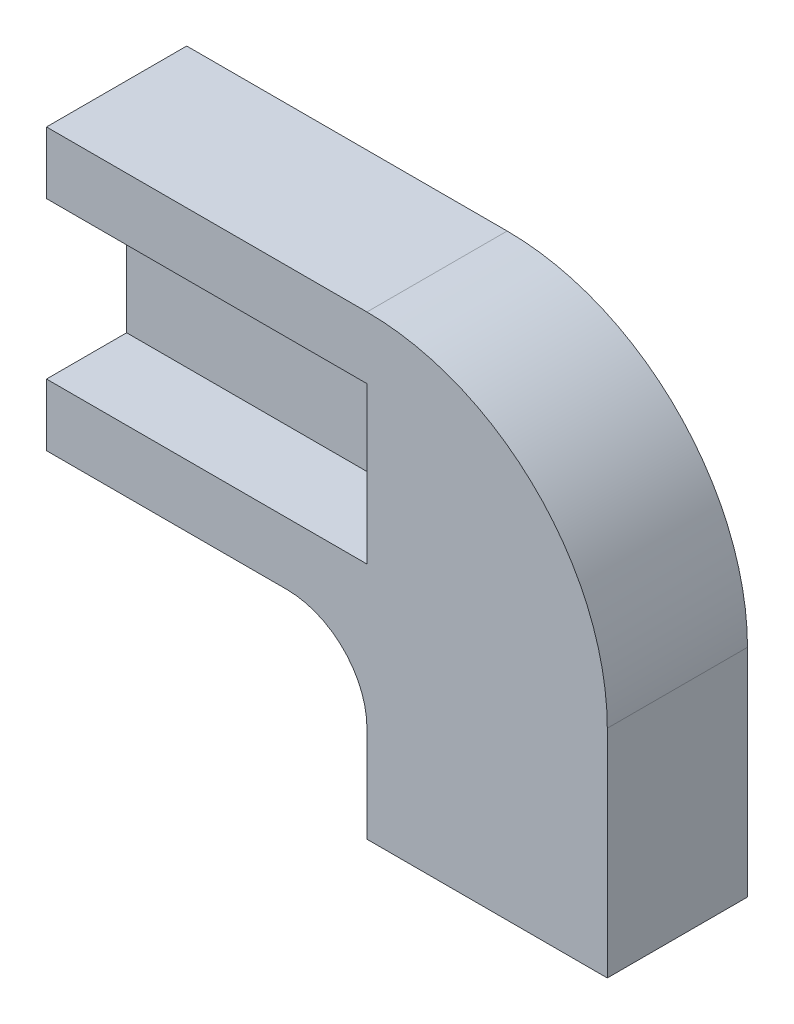
ISO-10303-21;
HEADER;
FILE_DESCRIPTION(('STEP AP214'),'2;1');
FILE_NAME('part.step','',(''),(''),'','','');
FILE_SCHEMA(('AUTOMOTIVE_DESIGN { 1 0 10303 214 1 1 1 1 }'));
ENDSEC;
DATA;
#1=APPLICATION_CONTEXT('core data for automotive mechanical design processes');
#2=APPLICATION_PROTOCOL_DEFINITION('international standard','automotive_design',2000,#1);
#3=PRODUCT_CONTEXT('',#1,'mechanical');
#4=PRODUCT('Part','Part','',(#3));
#5=PRODUCT_RELATED_PRODUCT_CATEGORY('part','',(#4));
#6=PRODUCT_DEFINITION_FORMATION('','',#4);
#7=PRODUCT_DEFINITION_CONTEXT('part definition',#1,'design');
#8=PRODUCT_DEFINITION('design','',#6,#7);
#9=PRODUCT_DEFINITION_SHAPE('','',#8);
#10=(LENGTH_UNIT() NAMED_UNIT(*) SI_UNIT(.MILLI.,.METRE.));
#11=(NAMED_UNIT(*) PLANE_ANGLE_UNIT() SI_UNIT($,.RADIAN.));
#12=(NAMED_UNIT(*) SI_UNIT($,.STERADIAN.) SOLID_ANGLE_UNIT());
#13=UNCERTAINTY_MEASURE_WITH_UNIT(LENGTH_MEASURE(1.E-05),#10,'distance_accuracy_value','');
#14=(GEOMETRIC_REPRESENTATION_CONTEXT(3) GLOBAL_UNCERTAINTY_ASSIGNED_CONTEXT((#13)) GLOBAL_UNIT_ASSIGNED_CONTEXT((#10,
#11,#12)) REPRESENTATION_CONTEXT('',''));
#15=CARTESIAN_POINT('',(0.,0.,0.));
#16=DIRECTION('',(0.,0.,1.));
#17=DIRECTION('',(1.,0.,0.));
#18=AXIS2_PLACEMENT_3D('',#15,#16,#17);
#19=CARTESIAN_POINT('',(0.,-8.89,4.445));
#20=DIRECTION('',(1.,0.,0.));
#21=DIRECTION('',(0.,0.,-1.));
#22=AXIS2_PLACEMENT_3D('',#19,#20,#21);
#23=PLANE('',#22);
#24=DIRECTION('',(0.,-1.,0.));
#25=VECTOR('',#24,1.);
#26=CARTESIAN_POINT('',(0.,-1.9685,1.905));
#27=LINE('',#26,#25);
#28=CARTESIAN_POINT('',(0.,-1.9685,1.905));
#29=VERTEX_POINT('',#28);
#30=CARTESIAN_POINT('',(0.,-6.9215,1.905));
#31=VERTEX_POINT('',#30);
#32=EDGE_CURVE('E132',#29,#31,#27,.T.);
#33=ORIENTED_EDGE('',*,*,#32,.F.);
#34=DIRECTION('',(0.,0.,1.));
#35=VECTOR('',#34,1.);
#36=CARTESIAN_POINT('',(0.,-1.9685,1.905));
#37=LINE('',#36,#35);
#38=CARTESIAN_POINT('',(0.,-1.9685,4.445));
#39=VERTEX_POINT('',#38);
#40=EDGE_CURVE('E171',#29,#39,#37,.T.);
#41=ORIENTED_EDGE('',*,*,#40,.T.);
#42=DIRECTION('',(0.,-1.,0.));
#43=VECTOR('',#42,1.);
#44=CARTESIAN_POINT('',(0.,-8.89,4.445));
#45=LINE('',#44,#43);
#46=CARTESIAN_POINT('',(0.,0.,4.445));
#47=VERTEX_POINT('',#46);
#48=EDGE_CURVE('E152',#47,#39,#45,.T.);
#49=ORIENTED_EDGE('',*,*,#48,.F.);
#50=DIRECTION('',(0.,0.,-1.));
#51=VECTOR('',#50,1.);
#52=CARTESIAN_POINT('',(0.,0.,4.445));
#53=LINE('',#52,#51);
#54=CARTESIAN_POINT('',(0.,0.,0.));
#55=VERTEX_POINT('',#54);
#56=EDGE_CURVE('E166',#47,#55,#53,.T.);
#57=ORIENTED_EDGE('',*,*,#56,.T.);
#58=DIRECTION('',(0.,-1.,0.));
#59=VECTOR('',#58,1.);
#60=CARTESIAN_POINT('',(0.,-8.89,0.));
#61=LINE('',#60,#59);
#62=CARTESIAN_POINT('',(0.,-8.89,0.));
#63=VERTEX_POINT('',#62);
#64=EDGE_CURVE('E167',#55,#63,#61,.T.);
#65=ORIENTED_EDGE('',*,*,#64,.T.);
#66=DIRECTION('',(0.,0.,-1.));
#67=VECTOR('',#66,1.);
#68=CARTESIAN_POINT('',(0.,-8.89,4.445));
#69=LINE('',#68,#67);
#70=CARTESIAN_POINT('',(0.,-8.89,4.445));
#71=VERTEX_POINT('',#70);
#72=EDGE_CURVE('E190',#71,#63,#69,.T.);
#73=ORIENTED_EDGE('',*,*,#72,.F.);
#74=CARTESIAN_POINT('',(0.,-6.9215,4.445));
#75=VERTEX_POINT('',#74);
#76=EDGE_CURVE('E145',#75,#71,#45,.T.);
#77=ORIENTED_EDGE('',*,*,#76,.F.);
#78=DIRECTION('',(0.,0.,1.));
#79=VECTOR('',#78,1.);
#80=CARTESIAN_POINT('',(0.,-6.9215,1.905));
#81=LINE('',#80,#79);
#82=EDGE_CURVE('E125',#31,#75,#81,.T.);
#83=ORIENTED_EDGE('',*,*,#82,.F.);
#84=EDGE_LOOP('',(#33,#41,#49,#57,#65,#73,#77,#83));
#85=FACE_BOUND('',#84,.T.);
#86=ADVANCED_FACE('F32',(#85),#23,.F.);
#87=CARTESIAN_POINT('',(10.16,-8.89,4.445));
#88=DIRECTION('',(0.,1.,0.));
#89=DIRECTION('',(-1.,0.,0.));
#90=AXIS2_PLACEMENT_3D('',#87,#88,#89);
#91=PLANE('',#90);
#92=DIRECTION('',(1.,0.,0.));
#93=VECTOR('',#92,1.);
#94=CARTESIAN_POINT('',(10.16,-8.89,0.));
#95=LINE('',#94,#93);
#96=CARTESIAN_POINT('',(7.62,-8.89,0.));
#97=VERTEX_POINT('',#96);
#98=EDGE_CURVE('E170',#63,#97,#95,.T.);
#99=ORIENTED_EDGE('',*,*,#98,.T.);
#100=DIRECTION('',(0.,0.,-1.));
#101=VECTOR('',#100,1.);
#102=CARTESIAN_POINT('',(7.62,-8.89,4.445));
#103=LINE('',#102,#101);
#104=CARTESIAN_POINT('',(7.62,-8.89,4.445));
#105=VERTEX_POINT('',#104);
#106=EDGE_CURVE('E196',#97,#105,#103,.F.);
#107=ORIENTED_EDGE('',*,*,#106,.T.);
#108=DIRECTION('',(1.,0.,0.));
#109=VECTOR('',#108,1.);
#110=CARTESIAN_POINT('',(10.16,-8.89,4.445));
#111=LINE('',#110,#109);
#112=EDGE_CURVE('E155',#71,#105,#111,.T.);
#113=ORIENTED_EDGE('',*,*,#112,.F.);
#114=ORIENTED_EDGE('',*,*,#72,.T.);
#115=EDGE_LOOP('',(#99,#107,#113,#114));
#116=FACE_BOUND('',#115,.T.);
#117=ADVANCED_FACE('F226',(#116),#91,.F.);
#118=CARTESIAN_POINT('',(10.16,-14.478,4.445));
#119=DIRECTION('',(1.,0.,0.));
#120=DIRECTION('',(0.,0.,-1.));
#121=AXIS2_PLACEMENT_3D('',#118,#119,#120);
#122=PLANE('',#121);
#123=DIRECTION('',(0.,-1.,0.));
#124=VECTOR('',#123,1.);
#125=CARTESIAN_POINT('',(10.16,-14.478,4.445));
#126=LINE('',#125,#124);
#127=CARTESIAN_POINT('',(10.16,-11.43,4.445));
#128=VERTEX_POINT('',#127);
#129=CARTESIAN_POINT('',(10.16,-14.478,4.445));
#130=VERTEX_POINT('',#129);
#131=EDGE_CURVE('E158',#128,#130,#126,.T.);
#132=ORIENTED_EDGE('',*,*,#131,.F.);
#133=DIRECTION('',(0.,0.,-1.));
#134=VECTOR('',#133,1.);
#135=CARTESIAN_POINT('',(10.16,-11.43,0.));
#136=LINE('',#135,#134);
#137=CARTESIAN_POINT('',(10.16,-11.43,0.));
#138=VERTEX_POINT('',#137);
#139=EDGE_CURVE('E193',#128,#138,#136,.T.);
#140=ORIENTED_EDGE('',*,*,#139,.T.);
#141=DIRECTION('',(0.,-1.,0.));
#142=VECTOR('',#141,1.);
#143=CARTESIAN_POINT('',(10.16,-14.478,0.));
#144=LINE('',#143,#142);
#145=CARTESIAN_POINT('',(10.16,-14.478,0.));
#146=VERTEX_POINT('',#145);
#147=EDGE_CURVE('E174',#138,#146,#144,.T.);
#148=ORIENTED_EDGE('',*,*,#147,.T.);
#149=DIRECTION('',(0.,0.,-1.));
#150=VECTOR('',#149,1.);
#151=CARTESIAN_POINT('',(10.16,-14.478,4.445));
#152=LINE('',#151,#150);
#153=EDGE_CURVE('E187',#130,#146,#152,.T.);
#154=ORIENTED_EDGE('',*,*,#153,.F.);
#155=EDGE_LOOP('',(#132,#140,#148,#154));
#156=FACE_BOUND('',#155,.T.);
#157=ADVANCED_FACE('F231',(#156),#122,.F.);
#158=CARTESIAN_POINT('',(17.78,-14.478,4.445));
#159=DIRECTION('',(0.,1.,0.));
#160=DIRECTION('',(-1.,0.,0.));
#161=AXIS2_PLACEMENT_3D('',#158,#159,#160);
#162=PLANE('',#161);
#163=DIRECTION('',(1.,0.,0.));
#164=VECTOR('',#163,1.);
#165=CARTESIAN_POINT('',(17.78,-14.478,0.));
#166=LINE('',#165,#164);
#167=CARTESIAN_POINT('',(17.78,-14.478,0.));
#168=VERTEX_POINT('',#167);
#169=EDGE_CURVE('E176',#146,#168,#166,.T.);
#170=ORIENTED_EDGE('',*,*,#169,.T.);
#171=DIRECTION('',(0.,0.,-1.));
#172=VECTOR('',#171,1.);
#173=CARTESIAN_POINT('',(17.78,-14.478,4.445));
#174=LINE('',#173,#172);
#175=CARTESIAN_POINT('',(17.78,-14.478,4.445));
#176=VERTEX_POINT('',#175);
#177=EDGE_CURVE('E184',#176,#168,#174,.T.);
#178=ORIENTED_EDGE('',*,*,#177,.F.);
#179=DIRECTION('',(1.,0.,0.));
#180=VECTOR('',#179,1.);
#181=CARTESIAN_POINT('',(17.78,-14.478,4.445));
#182=LINE('',#181,#180);
#183=EDGE_CURVE('E160',#130,#176,#182,.T.);
#184=ORIENTED_EDGE('',*,*,#183,.F.);
#185=ORIENTED_EDGE('',*,*,#153,.T.);
#186=EDGE_LOOP('',(#170,#178,#184,#185));
#187=FACE_BOUND('',#186,.T.);
#188=ADVANCED_FACE('F237',(#187),#162,.F.);
#189=CARTESIAN_POINT('',(17.78,0.,4.445));
#190=DIRECTION('',(-1.,0.,0.));
#191=DIRECTION('',(0.,0.,1.));
#192=AXIS2_PLACEMENT_3D('',#189,#190,#191);
#193=PLANE('',#192);
#194=DIRECTION('',(0.,1.,0.));
#195=VECTOR('',#194,1.);
#196=CARTESIAN_POINT('',(17.78,0.,0.));
#197=LINE('',#196,#195);
#198=CARTESIAN_POINT('',(17.78,-7.62,0.));
#199=VERTEX_POINT('',#198);
#200=EDGE_CURVE('E178',#168,#199,#197,.T.);
#201=ORIENTED_EDGE('',*,*,#200,.T.);
#202=DIRECTION('',(0.,0.,-1.));
#203=VECTOR('',#202,1.);
#204=CARTESIAN_POINT('',(17.78,-7.62,4.445));
#205=LINE('',#204,#203);
#206=CARTESIAN_POINT('',(17.78,-7.62,4.445));
#207=VERTEX_POINT('',#206);
#208=EDGE_CURVE('E40',#199,#207,#205,.F.);
#209=ORIENTED_EDGE('',*,*,#208,.T.);
#210=DIRECTION('',(0.,1.,0.));
#211=VECTOR('',#210,1.);
#212=CARTESIAN_POINT('',(17.78,0.,4.445));
#213=LINE('',#212,#211);
#214=EDGE_CURVE('E162',#176,#207,#213,.T.);
#215=ORIENTED_EDGE('',*,*,#214,.F.);
#216=ORIENTED_EDGE('',*,*,#177,.T.);
#217=EDGE_LOOP('',(#201,#209,#215,#216));
#218=FACE_BOUND('',#217,.T.);
#219=ADVANCED_FACE('F241',(#218),#193,.F.);
#220=CARTESIAN_POINT('',(0.,0.,4.445));
#221=DIRECTION('',(0.,-1.,0.));
#222=DIRECTION('',(0.,0.,-1.));
#223=AXIS2_PLACEMENT_3D('',#220,#221,#222);
#224=PLANE('',#223);
#225=DIRECTION('',(-1.,0.,0.));
#226=VECTOR('',#225,1.);
#227=CARTESIAN_POINT('',(0.,0.,4.445));
#228=LINE('',#227,#226);
#229=CARTESIAN_POINT('',(10.16,0.,4.445));
#230=VERTEX_POINT('',#229);
#231=EDGE_CURVE('E164',#230,#47,#228,.T.);
#232=ORIENTED_EDGE('',*,*,#231,.F.);
#233=DIRECTION('',(0.,0.,-1.));
#234=VECTOR('',#233,1.);
#235=CARTESIAN_POINT('',(10.16,0.,4.445));
#236=LINE('',#235,#234);
#237=CARTESIAN_POINT('',(10.16,0.,0.));
#238=VERTEX_POINT('',#237);
#239=EDGE_CURVE('E202',#230,#238,#236,.T.);
#240=ORIENTED_EDGE('',*,*,#239,.T.);
#241=DIRECTION('',(-1.,0.,0.));
#242=VECTOR('',#241,1.);
#243=CARTESIAN_POINT('',(0.,0.,0.));
#244=LINE('',#243,#242);
#245=EDGE_CURVE('E180',#238,#55,#244,.T.);
#246=ORIENTED_EDGE('',*,*,#245,.T.);
#247=ORIENTED_EDGE('',*,*,#56,.F.);
#248=EDGE_LOOP('',(#232,#240,#246,#247));
#249=FACE_BOUND('',#248,.T.);
#250=ADVANCED_FACE('F208',(#249),#224,.F.);
#251=CARTESIAN_POINT('',(0.,0.,4.445));
#252=DIRECTION('',(0.,0.,-1.));
#253=DIRECTION('',(-1.,0.,0.));
#254=AXIS2_PLACEMENT_3D('',#251,#252,#253);
#255=PLANE('',#254);
#256=ORIENTED_EDGE('',*,*,#214,.T.);
#257=CARTESIAN_POINT('',(10.16,-7.62,4.445));
#258=DIRECTION('',(0.,0.,-1.));
#259=DIRECTION('',(-1.,0.,0.));
#260=AXIS2_PLACEMENT_3D('',#257,#258,#259);
#261=CIRCLE('',#260,7.62);
#262=EDGE_CURVE('E11',#207,#230,#261,.F.);
#263=ORIENTED_EDGE('',*,*,#262,.T.);
#264=ORIENTED_EDGE('',*,*,#231,.T.);
#265=ORIENTED_EDGE('',*,*,#48,.T.);
#266=DIRECTION('',(-1.,0.,0.));
#267=VECTOR('',#266,1.);
#268=CARTESIAN_POINT('',(10.16,-1.9685,4.445));
#269=LINE('',#268,#267);
#270=CARTESIAN_POINT('',(10.16,-1.9685,4.445));
#271=VERTEX_POINT('',#270);
#272=EDGE_CURVE('E141',#271,#39,#269,.T.);
#273=ORIENTED_EDGE('',*,*,#272,.F.);
#274=DIRECTION('',(0.,1.,0.));
#275=VECTOR('',#274,1.);
#276=CARTESIAN_POINT('',(10.16,-1.9685,4.445));
#277=LINE('',#276,#275);
#278=CARTESIAN_POINT('',(10.16,-6.9215,4.445));
#279=VERTEX_POINT('',#278);
#280=EDGE_CURVE('E343',#279,#271,#277,.T.);
#281=ORIENTED_EDGE('',*,*,#280,.F.);
#282=DIRECTION('',(1.,0.,0.));
#283=VECTOR('',#282,1.);
#284=CARTESIAN_POINT('',(10.16,-6.9215,4.445));
#285=LINE('',#284,#283);
#286=EDGE_CURVE('E345',#75,#279,#285,.T.);
#287=ORIENTED_EDGE('',*,*,#286,.F.);
#288=ORIENTED_EDGE('',*,*,#76,.T.);
#289=ORIENTED_EDGE('',*,*,#112,.T.);
#290=CARTESIAN_POINT('',(7.62,-11.43,4.445));
#291=DIRECTION('',(0.,0.,-1.));
#292=DIRECTION('',(-1.,0.,0.));
#293=AXIS2_PLACEMENT_3D('',#290,#291,#292);
#294=CIRCLE('',#293,2.54);
#295=EDGE_CURVE('E200',#105,#128,#294,.T.);
#296=ORIENTED_EDGE('',*,*,#295,.T.);
#297=ORIENTED_EDGE('',*,*,#131,.T.);
#298=ORIENTED_EDGE('',*,*,#183,.T.);
#299=EDGE_LOOP('',(#256,#263,#264,#265,#273,#281,#287,#288,#289,#296,#297,#298));
#300=FACE_BOUND('',#299,.T.);
#301=ADVANCED_FACE('F217',(#300),#255,.F.);
#302=CARTESIAN_POINT('',(0.,0.,0.));
#303=DIRECTION('',(0.,0.,-1.));
#304=DIRECTION('',(-1.,0.,0.));
#305=AXIS2_PLACEMENT_3D('',#302,#303,#304);
#306=PLANE('',#305);
#307=ORIENTED_EDGE('',*,*,#245,.F.);
#308=CARTESIAN_POINT('',(10.16,-7.62,0.));
#309=DIRECTION('',(0.,0.,-1.));
#310=DIRECTION('',(-1.,0.,0.));
#311=AXIS2_PLACEMENT_3D('',#308,#309,#310);
#312=CIRCLE('',#311,7.62);
#313=EDGE_CURVE('E54',#238,#199,#312,.T.);
#314=ORIENTED_EDGE('',*,*,#313,.T.);
#315=ORIENTED_EDGE('',*,*,#200,.F.);
#316=ORIENTED_EDGE('',*,*,#169,.F.);
#317=ORIENTED_EDGE('',*,*,#147,.F.);
#318=CARTESIAN_POINT('',(7.62,-11.43,0.));
#319=DIRECTION('',(0.,0.,-1.));
#320=DIRECTION('',(-1.,0.,0.));
#321=AXIS2_PLACEMENT_3D('',#318,#319,#320);
#322=CIRCLE('',#321,2.54);
#323=EDGE_CURVE('E198',#138,#97,#322,.F.);
#324=ORIENTED_EDGE('',*,*,#323,.T.);
#325=ORIENTED_EDGE('',*,*,#98,.F.);
#326=ORIENTED_EDGE('',*,*,#64,.F.);
#327=EDGE_LOOP('',(#307,#314,#315,#316,#317,#324,#325,#326));
#328=FACE_BOUND('',#327,.T.);
#329=ADVANCED_FACE('F213',(#328),#306,.T.);
#330=CARTESIAN_POINT('',(10.16,-1.9685,1.905));
#331=DIRECTION('',(0.,1.,0.));
#332=DIRECTION('',(-1.,0.,0.));
#333=AXIS2_PLACEMENT_3D('',#330,#331,#332);
#334=PLANE('',#333);
#335=ORIENTED_EDGE('',*,*,#272,.T.);
#336=ORIENTED_EDGE('',*,*,#40,.F.);
#337=DIRECTION('',(-1.,0.,0.));
#338=VECTOR('',#337,1.);
#339=CARTESIAN_POINT('',(10.16,-1.9685,1.905));
#340=LINE('',#339,#338);
#341=CARTESIAN_POINT('',(10.16,-1.9685,1.905));
#342=VERTEX_POINT('',#341);
#343=EDGE_CURVE('E138',#342,#29,#340,.T.);
#344=ORIENTED_EDGE('',*,*,#343,.F.);
#345=DIRECTION('',(0.,0.,1.));
#346=VECTOR('',#345,1.);
#347=CARTESIAN_POINT('',(10.16,-1.9685,1.905));
#348=LINE('',#347,#346);
#349=EDGE_CURVE('E147',#342,#271,#348,.T.);
#350=ORIENTED_EDGE('',*,*,#349,.T.);
#351=EDGE_LOOP('',(#335,#336,#344,#350));
#352=FACE_BOUND('',#351,.T.);
#353=ADVANCED_FACE('F249',(#352),#334,.F.);
#354=CARTESIAN_POINT('',(10.16,-1.9685,1.905));
#355=DIRECTION('',(1.,0.,0.));
#356=DIRECTION('',(0.,0.,-1.));
#357=AXIS2_PLACEMENT_3D('',#354,#355,#356);
#358=PLANE('',#357);
#359=ORIENTED_EDGE('',*,*,#280,.T.);
#360=ORIENTED_EDGE('',*,*,#349,.F.);
#361=DIRECTION('',(0.,1.,0.));
#362=VECTOR('',#361,1.);
#363=CARTESIAN_POINT('',(10.16,-1.9685,1.905));
#364=LINE('',#363,#362);
#365=CARTESIAN_POINT('',(10.16,-6.9215,1.905));
#366=VERTEX_POINT('',#365);
#367=EDGE_CURVE('E131',#366,#342,#364,.T.);
#368=ORIENTED_EDGE('',*,*,#367,.F.);
#369=DIRECTION('',(0.,0.,1.));
#370=VECTOR('',#369,1.);
#371=CARTESIAN_POINT('',(10.16,-6.9215,1.905));
#372=LINE('',#371,#370);
#373=EDGE_CURVE('E127',#366,#279,#372,.T.);
#374=ORIENTED_EDGE('',*,*,#373,.T.);
#375=EDGE_LOOP('',(#359,#360,#368,#374));
#376=FACE_BOUND('',#375,.T.);
#377=ADVANCED_FACE('F254',(#376),#358,.F.);
#378=CARTESIAN_POINT('',(10.16,-6.9215,1.905));
#379=DIRECTION('',(0.,-1.,0.));
#380=DIRECTION('',(1.,0.,0.));
#381=AXIS2_PLACEMENT_3D('',#378,#379,#380);
#382=PLANE('',#381);
#383=ORIENTED_EDGE('',*,*,#286,.T.);
#384=ORIENTED_EDGE('',*,*,#373,.F.);
#385=DIRECTION('',(1.,0.,0.));
#386=VECTOR('',#385,1.);
#387=CARTESIAN_POINT('',(10.16,-6.9215,1.905));
#388=LINE('',#387,#386);
#389=EDGE_CURVE('E120',#31,#366,#388,.T.);
#390=ORIENTED_EDGE('',*,*,#389,.F.);
#391=ORIENTED_EDGE('',*,*,#82,.T.);
#392=EDGE_LOOP('',(#383,#384,#390,#391));
#393=FACE_BOUND('',#392,.T.);
#394=ADVANCED_FACE('F123',(#393),#382,.F.);
#395=CARTESIAN_POINT('',(0.,0.,1.905));
#396=DIRECTION('',(0.,0.,-1.));
#397=DIRECTION('',(-1.,0.,0.));
#398=AXIS2_PLACEMENT_3D('',#395,#396,#397);
#399=PLANE('',#398);
#400=ORIENTED_EDGE('',*,*,#32,.T.);
#401=ORIENTED_EDGE('',*,*,#389,.T.);
#402=ORIENTED_EDGE('',*,*,#367,.T.);
#403=ORIENTED_EDGE('',*,*,#343,.T.);
#404=EDGE_LOOP('',(#400,#401,#402,#403));
#405=FACE_BOUND('',#404,.T.);
#406=ADVANCED_FACE('F136',(#405),#399,.F.);
#407=CARTESIAN_POINT('',(7.62,-11.43,4.445));
#408=DIRECTION('',(0.,0.,1.));
#409=DIRECTION('',(1.,0.,0.));
#410=AXIS2_PLACEMENT_3D('',#407,#408,#409);
#411=CYLINDRICAL_SURFACE('',#410,2.54);
#412=ORIENTED_EDGE('',*,*,#295,.F.);
#413=ORIENTED_EDGE('',*,*,#106,.F.);
#414=ORIENTED_EDGE('',*,*,#323,.F.);
#415=ORIENTED_EDGE('',*,*,#139,.F.);
#416=EDGE_LOOP('',(#412,#413,#414,#415));
#417=FACE_BOUND('',#416,.T.);
#418=ADVANCED_FACE('F220',(#417),#411,.F.);
#419=CARTESIAN_POINT('',(10.16,-7.62,4.445));
#420=DIRECTION('',(0.,0.,-1.));
#421=DIRECTION('',(-1.,0.,0.));
#422=AXIS2_PLACEMENT_3D('',#419,#420,#421);
#423=CYLINDRICAL_SURFACE('',#422,7.62);
#424=ORIENTED_EDGE('',*,*,#262,.F.);
#425=ORIENTED_EDGE('',*,*,#208,.F.);
#426=ORIENTED_EDGE('',*,*,#313,.F.);
#427=ORIENTED_EDGE('',*,*,#239,.F.);
#428=EDGE_LOOP('',(#424,#425,#426,#427));
#429=FACE_BOUND('',#428,.T.);
#430=ADVANCED_FACE('F34',(#429),#423,.T.);
#431=CLOSED_SHELL('',(#86,#117,#157,#188,#219,#250,#301,#329,#353,#377,#394,#406,#418,#430));
#432=MANIFOLD_SOLID_BREP('B2',#431);
#433=ADVANCED_BREP_SHAPE_REPRESENTATION('',(#18,#432),#14);
#434=SHAPE_DEFINITION_REPRESENTATION(#9,#433);
ENDSEC;
END-ISO-10303-21;
